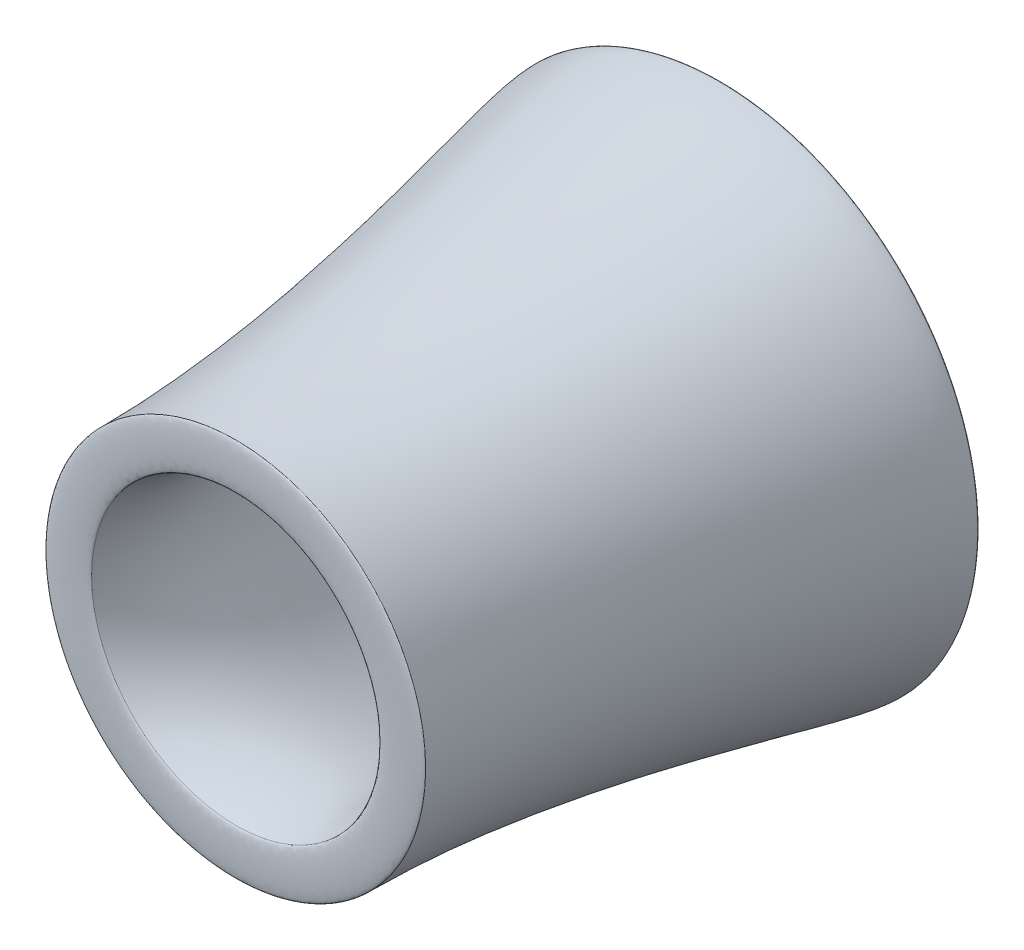
ISO-10303-21;
HEADER;
FILE_DESCRIPTION(('STEP AP214'),'2;1');
FILE_NAME('part.step','',(''),(''),'','','');
FILE_SCHEMA(('AUTOMOTIVE_DESIGN { 1 0 10303 214 1 1 1 1 }'));
ENDSEC;
DATA;
#1=APPLICATION_CONTEXT('core data for automotive mechanical design processes');
#2=APPLICATION_PROTOCOL_DEFINITION('international standard','automotive_design',2000,#1);
#3=PRODUCT_CONTEXT('',#1,'mechanical');
#4=PRODUCT('Part','Part','',(#3));
#5=PRODUCT_RELATED_PRODUCT_CATEGORY('part','',(#4));
#6=PRODUCT_DEFINITION_FORMATION('','',#4);
#7=PRODUCT_DEFINITION_CONTEXT('part definition',#1,'design');
#8=PRODUCT_DEFINITION('design','',#6,#7);
#9=PRODUCT_DEFINITION_SHAPE('','',#8);
#10=(LENGTH_UNIT() NAMED_UNIT(*) SI_UNIT(.MILLI.,.METRE.));
#11=(NAMED_UNIT(*) PLANE_ANGLE_UNIT() SI_UNIT($,.RADIAN.));
#12=(NAMED_UNIT(*) SI_UNIT($,.STERADIAN.) SOLID_ANGLE_UNIT());
#13=UNCERTAINTY_MEASURE_WITH_UNIT(LENGTH_MEASURE(1.E-05),#10,'distance_accuracy_value','');
#14=(GEOMETRIC_REPRESENTATION_CONTEXT(3) GLOBAL_UNCERTAINTY_ASSIGNED_CONTEXT((#13)) GLOBAL_UNIT_ASSIGNED_CONTEXT((#10,
#11,#12)) REPRESENTATION_CONTEXT('',''));
#15=CARTESIAN_POINT('',(0.,0.,0.));
#16=DIRECTION('',(0.,0.,1.));
#17=DIRECTION('',(1.,0.,0.));
#18=AXIS2_PLACEMENT_3D('',#15,#16,#17);
#19=CARTESIAN_POINT('',(-639.334180405847,0.,1251.9957756992));
#20=CARTESIAN_POINT('',(-639.334180405847,0.,1264.6957756992));
#21=CARTESIAN_POINT('',(-486.277635525909,0.,1264.6957756992));
#22=CARTESIAN_POINT('',(-486.277635525909,0.,1251.9957756992));
#23=B_SPLINE_CURVE_WITH_KNOTS('',3,(#19,#20,#21,#22),.UNSPECIFIED.,.F.,.F.,(4,4),(0.,1.),.UNSPECIFIED.);
#24=CARTESIAN_POINT('',(0.,0.,1104.75683012291));
#25=DIRECTION('',(0.,0.,1.));
#26=AXIS1_PLACEMENT('',#24,#25);
#27=SURFACE_OF_REVOLUTION('',#23,#26);
#28=CARTESIAN_POINT('',(0.,0.,1251.9957756992));
#29=DIRECTION('',(0.,0.,1.));
#30=DIRECTION('',(1.,0.,0.));
#31=AXIS2_PLACEMENT_3D('',#28,#29,#30);
#32=CIRCLE('',#31,486.277635525909);
#33=CARTESIAN_POINT('',(486.277635525909,0.,1251.9957756992));
#34=VERTEX_POINT('',#33);
#35=EDGE_CURVE('E48',#34,#34,#32,.T.);
#36=ORIENTED_EDGE('',*,*,#35,.F.);
#37=EDGE_LOOP('',(#36));
#38=FACE_BOUND('',#37,.T.);
#39=CARTESIAN_POINT('',(0.,0.,1251.9957756992));
#40=DIRECTION('',(0.,0.,1.));
#41=DIRECTION('',(1.,0.,0.));
#42=AXIS2_PLACEMENT_3D('',#39,#40,#41);
#43=CIRCLE('',#42,639.334180405847);
#44=CARTESIAN_POINT('',(639.334180405847,0.,1251.9957756992));
#45=VERTEX_POINT('',#44);
#46=EDGE_CURVE('E11',#45,#45,#43,.T.);
#47=ORIENTED_EDGE('',*,*,#46,.T.);
#48=EDGE_LOOP('',(#47));
#49=FACE_BOUND('',#48,.T.);
#50=ADVANCED_FACE('F41',(#38,#49),#27,.T.);
#51=CARTESIAN_POINT('',(-639.334180405847,0.,1251.9957756992));
#52=DIRECTION('',(0.,0.,1.));
#53=DIRECTION('',(1.,0.,0.));
#54=AXIS2_PLACEMENT_3D('',#51,#52,#53);
#55=PLANE('',#54);
#56=ORIENTED_EDGE('',*,*,#46,.F.);
#57=EDGE_LOOP('',(#56));
#58=FACE_BOUND('',#57,.T.);
#59=ORIENTED_EDGE('',*,*,#35,.T.);
#60=EDGE_LOOP('',(#59));
#61=FACE_BOUND('',#60,.T.);
#62=ADVANCED_FACE('F60',(#58,#61),#55,.F.);
#63=CLOSED_SHELL('',(#50,#62));
#64=MANIFOLD_SOLID_BREP('B2',#63);
#65=CARTESIAN_POINT('',(-710.453833657276,0.,-376.226327562335));
#66=CARTESIAN_POINT('',(-710.453833657276,0.,-393.159660895669));
#67=CARTESIAN_POINT('',(-871.564148404914,0.,-393.159660895669));
#68=CARTESIAN_POINT('',(-871.564148404914,0.,-376.226327562335));
#69=B_SPLINE_CURVE_WITH_KNOTS('',3,(#65,#66,#67,#68),.UNSPECIFIED.,.F.,.F.,(4,4),(0.,1.),.UNSPECIFIED.);
#70=CARTESIAN_POINT('',(0.,0.,99.6847843209707));
#71=DIRECTION('',(0.,0.,1.));
#72=AXIS1_PLACEMENT('',#70,#71);
#73=SURFACE_OF_REVOLUTION('',#69,#72);
#74=CARTESIAN_POINT('',(0.,0.,-376.226327562335));
#75=DIRECTION('',(0.,0.,1.));
#76=DIRECTION('',(1.,0.,0.));
#77=AXIS2_PLACEMENT_3D('',#74,#75,#76);
#78=CIRCLE('',#77,871.564148404914);
#79=CARTESIAN_POINT('',(871.564148404914,0.,-376.226327562335));
#80=VERTEX_POINT('',#79);
#81=EDGE_CURVE('E40',#80,#80,#78,.T.);
#82=ORIENTED_EDGE('',*,*,#81,.F.);
#83=EDGE_LOOP('',(#82));
#84=FACE_BOUND('',#83,.T.);
#85=CARTESIAN_POINT('',(0.,0.,-376.226327562335));
#86=DIRECTION('',(0.,0.,1.));
#87=DIRECTION('',(1.,0.,0.));
#88=AXIS2_PLACEMENT_3D('',#85,#86,#87);
#89=CIRCLE('',#88,710.453833657276);
#90=CARTESIAN_POINT('',(710.453833657276,0.,-376.226327562335));
#91=VERTEX_POINT('',#90);
#92=EDGE_CURVE('E93',#91,#91,#89,.T.);
#93=ORIENTED_EDGE('',*,*,#92,.T.);
#94=EDGE_LOOP('',(#93));
#95=FACE_BOUND('',#94,.T.);
#96=ADVANCED_FACE('F86',(#84,#95),#73,.T.);
#97=CARTESIAN_POINT('',(-871.564148404914,0.,-376.226327562335));
#98=DIRECTION('',(0.,0.,-1.));
#99=DIRECTION('',(-1.,0.,0.));
#100=AXIS2_PLACEMENT_3D('',#97,#98,#99);
#101=PLANE('',#100);
#102=ORIENTED_EDGE('',*,*,#92,.F.);
#103=EDGE_LOOP('',(#102));
#104=FACE_BOUND('',#103,.T.);
#105=ORIENTED_EDGE('',*,*,#81,.T.);
#106=EDGE_LOOP('',(#105));
#107=FACE_BOUND('',#106,.T.);
#108=ADVANCED_FACE('F106',(#104,#107),#101,.F.);
#109=CLOSED_SHELL('',(#96,#108));
#110=MANIFOLD_SOLID_BREP('B6',#109);
#111=CARTESIAN_POINT('',(-486.277635525909,0.,1251.9957756992));
#112=CARTESIAN_POINT('',(-344.132485944167,0.,890.184387248298));
#113=CARTESIAN_POINT('',(-670.556964644076,0.,438.724566684066));
#114=CARTESIAN_POINT('',(-720.021859821345,0.,-125.212813058769));
#115=CARTESIAN_POINT('',(-710.453833657276,0.,-376.226327562335));
#116=B_SPLINE_CURVE_WITH_KNOTS('',3,(#111,#112,#113,#114,#115),.UNSPECIFIED.,.F.,.F.,(4,1,4),
(0.,0.793493092504956,1.),.UNSPECIFIED.);
#117=CARTESIAN_POINT('',(0.,0.,99.6847843209707));
#118=DIRECTION('',(0.,0.,1.));
#119=AXIS1_PLACEMENT('',#117,#118);
#120=SURFACE_OF_REVOLUTION('',#116,#119);
#121=CARTESIAN_POINT('',(0.,0.,-376.226327562335));
#122=DIRECTION('',(0.,0.,1.));
#123=DIRECTION('',(1.,0.,0.));
#124=AXIS2_PLACEMENT_3D('',#121,#122,#123);
#125=CIRCLE('',#124,710.453833657276);
#126=CARTESIAN_POINT('',(710.453833657276,0.,-376.226327562335));
#127=VERTEX_POINT('',#126);
#128=EDGE_CURVE('E139',#127,#127,#125,.T.);
#129=ORIENTED_EDGE('',*,*,#128,.F.);
#130=EDGE_LOOP('',(#129));
#131=FACE_BOUND('',#130,.T.);
#132=CARTESIAN_POINT('',(0.,0.,1251.9957756992));
#133=DIRECTION('',(0.,0.,1.));
#134=DIRECTION('',(1.,0.,0.));
#135=AXIS2_PLACEMENT_3D('',#132,#133,#134);
#136=CIRCLE('',#135,486.277635525909);
#137=CARTESIAN_POINT('',(486.277635525909,0.,1251.9957756992));
#138=VERTEX_POINT('',#137);
#139=EDGE_CURVE('E85',#138,#138,#136,.T.);
#140=ORIENTED_EDGE('',*,*,#139,.T.);
#141=EDGE_LOOP('',(#140));
#142=FACE_BOUND('',#141,.T.);
#143=ADVANCED_FACE('F124',(#131,#142),#120,.T.);
#144=CARTESIAN_POINT('',(-486.277635525909,0.,1251.9957756992));
#145=DIRECTION('',(0.,0.,-1.));
#146=DIRECTION('',(-1.,0.,0.));
#147=AXIS2_PLACEMENT_3D('',#144,#145,#146);
#148=PLANE('',#147);
#149=ORIENTED_EDGE('',*,*,#139,.F.);
#150=EDGE_LOOP('',(#149));
#151=FACE_BOUND('',#150,.T.);
#152=CARTESIAN_POINT('',(0.,0.,1251.9957756992));
#153=DIRECTION('',(0.,0.,1.));
#154=DIRECTION('',(1.,0.,0.));
#155=AXIS2_PLACEMENT_3D('',#152,#153,#154);
#156=CIRCLE('',#155,639.334180405847);
#157=CARTESIAN_POINT('',(639.334180405847,0.,1251.9957756992));
#158=VERTEX_POINT('',#157);
#159=EDGE_CURVE('E131',#158,#158,#156,.T.);
#160=ORIENTED_EDGE('',*,*,#159,.T.);
#161=EDGE_LOOP('',(#160));
#162=FACE_BOUND('',#161,.T.);
#163=ADVANCED_FACE('F158',(#151,#162),#148,.F.);
#164=CARTESIAN_POINT('',(-871.564148404914,0.,-376.226327562335));
#165=CARTESIAN_POINT('',(-871.564148404914,0.,-250.842375186043));
#166=CARTESIAN_POINT('',(-639.334180405846,0.,521.686655313903));
#167=CARTESIAN_POINT('',(-639.334180405847,0.,1251.9957756992));
#168=B_SPLINE_CURVE_WITH_KNOTS('',3,(#164,#165,#166,#167),.UNSPECIFIED.,.F.,.F.,(4,4),(0.,1.),.UNSPECIFIED.);
#169=CARTESIAN_POINT('',(0.,0.,99.6847843209707));
#170=DIRECTION('',(0.,0.,1.));
#171=AXIS1_PLACEMENT('',#169,#170);
#172=SURFACE_OF_REVOLUTION('',#168,#171);
#173=ORIENTED_EDGE('',*,*,#159,.F.);
#174=EDGE_LOOP('',(#173));
#175=FACE_BOUND('',#174,.T.);
#176=CARTESIAN_POINT('',(0.,0.,-376.226327562335));
#177=DIRECTION('',(0.,0.,1.));
#178=DIRECTION('',(1.,0.,0.));
#179=AXIS2_PLACEMENT_3D('',#176,#177,#178);
#180=CIRCLE('',#179,871.564148404914);
#181=CARTESIAN_POINT('',(871.564148404914,0.,-376.226327562335));
#182=VERTEX_POINT('',#181);
#183=EDGE_CURVE('E135',#182,#182,#180,.T.);
#184=ORIENTED_EDGE('',*,*,#183,.T.);
#185=EDGE_LOOP('',(#184));
#186=FACE_BOUND('',#185,.T.);
#187=ADVANCED_FACE('F154',(#175,#186),#172,.T.);
#188=CARTESIAN_POINT('',(-710.453833657276,0.,-376.226327562335));
#189=DIRECTION('',(0.,0.,1.));
#190=DIRECTION('',(1.,0.,0.));
#191=AXIS2_PLACEMENT_3D('',#188,#189,#190);
#192=PLANE('',#191);
#193=ORIENTED_EDGE('',*,*,#183,.F.);
#194=EDGE_LOOP('',(#193));
#195=FACE_BOUND('',#194,.T.);
#196=ORIENTED_EDGE('',*,*,#128,.T.);
#197=EDGE_LOOP('',(#196));
#198=FACE_BOUND('',#197,.T.);
#199=ADVANCED_FACE('F157',(#195,#198),#192,.F.);
#200=CLOSED_SHELL('',(#143,#163,#187,#199));
#201=MANIFOLD_SOLID_BREP('B35',#200);
#202=ADVANCED_BREP_SHAPE_REPRESENTATION('',(#18,#64,#110,#201),#14);
#203=SHAPE_DEFINITION_REPRESENTATION(#9,#202);
ENDSEC;
END-ISO-10303-21;
